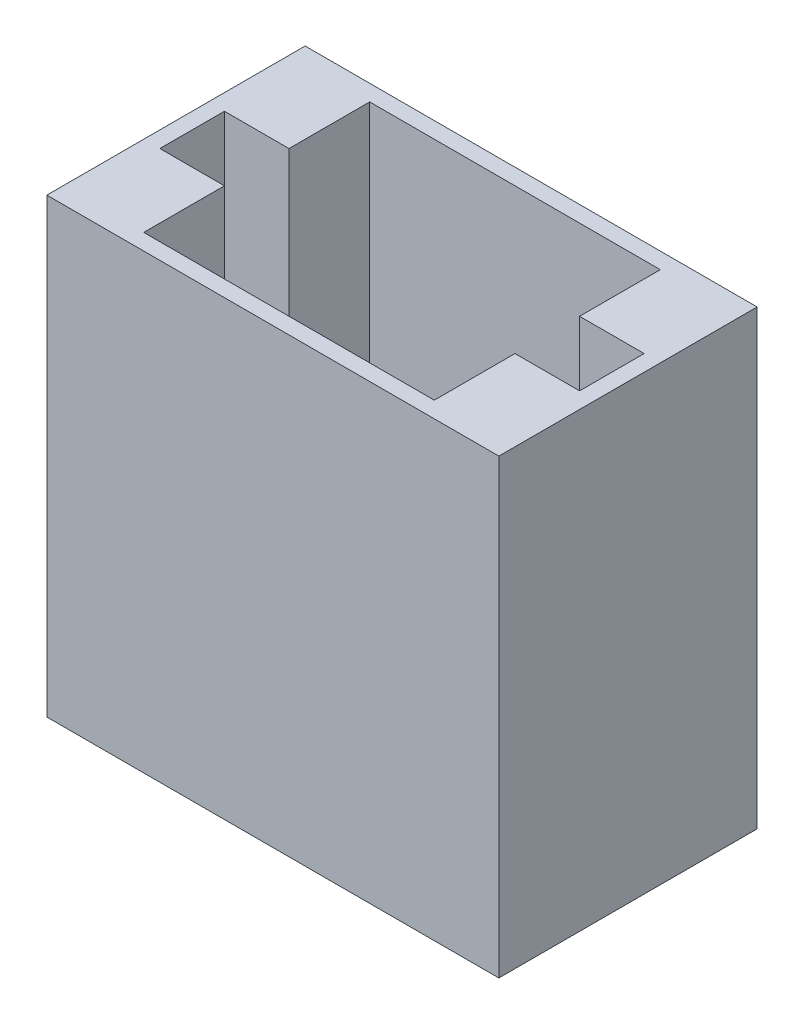
ISO-10303-21;
HEADER;
FILE_DESCRIPTION(('STEP AP214'),'2;1');
FILE_NAME('part.step','',(''),(''),'','','');
FILE_SCHEMA(('AUTOMOTIVE_DESIGN { 1 0 10303 214 1 1 1 1 }'));
ENDSEC;
DATA;
#1=APPLICATION_CONTEXT('core data for automotive mechanical design processes');
#2=APPLICATION_PROTOCOL_DEFINITION('international standard','automotive_design',2000,#1);
#3=PRODUCT_CONTEXT('',#1,'mechanical');
#4=PRODUCT('Part','Part','',(#3));
#5=PRODUCT_RELATED_PRODUCT_CATEGORY('part','',(#4));
#6=PRODUCT_DEFINITION_FORMATION('','',#4);
#7=PRODUCT_DEFINITION_CONTEXT('part definition',#1,'design');
#8=PRODUCT_DEFINITION('design','',#6,#7);
#9=PRODUCT_DEFINITION_SHAPE('','',#8);
#10=(LENGTH_UNIT() NAMED_UNIT(*) SI_UNIT(.MILLI.,.METRE.));
#11=(NAMED_UNIT(*) PLANE_ANGLE_UNIT() SI_UNIT($,.RADIAN.));
#12=(NAMED_UNIT(*) SI_UNIT($,.STERADIAN.) SOLID_ANGLE_UNIT());
#13=UNCERTAINTY_MEASURE_WITH_UNIT(LENGTH_MEASURE(1.E-05),#10,'distance_accuracy_value','');
#14=(GEOMETRIC_REPRESENTATION_CONTEXT(3) GLOBAL_UNCERTAINTY_ASSIGNED_CONTEXT((#13)) GLOBAL_UNIT_ASSIGNED_CONTEXT((#10,
#11,#12)) REPRESENTATION_CONTEXT('',''));
#15=CARTESIAN_POINT('',(0.,0.,0.));
#16=DIRECTION('',(0.,0.,1.));
#17=DIRECTION('',(1.,0.,0.));
#18=AXIS2_PLACEMENT_3D('',#15,#16,#17);
#19=CARTESIAN_POINT('',(32.5,0.,-17.5));
#20=DIRECTION('',(1.,0.,0.));
#21=DIRECTION('',(0.,0.,-1.));
#22=AXIS2_PLACEMENT_3D('',#19,#20,#21);
#23=PLANE('',#22);
#24=DIRECTION('',(0.,0.,-1.));
#25=VECTOR('',#24,1.);
#26=CARTESIAN_POINT('',(32.5,70.,-17.5));
#27=LINE('',#26,#25);
#28=CARTESIAN_POINT('',(32.5,70.,5.));
#29=VERTEX_POINT('',#28);
#30=CARTESIAN_POINT('',(32.5,70.,-5.));
#31=VERTEX_POINT('',#30);
#32=EDGE_CURVE('E182',#29,#31,#27,.T.);
#33=ORIENTED_EDGE('',*,*,#32,.T.);
#34=DIRECTION('',(0.,-1.,0.));
#35=VECTOR('',#34,1.);
#36=CARTESIAN_POINT('',(32.5,0.,-5.));
#37=LINE('',#36,#35);
#38=CARTESIAN_POINT('',(32.5,0.,-5.));
#39=VERTEX_POINT('',#38);
#40=EDGE_CURVE('E439',#31,#39,#37,.T.);
#41=ORIENTED_EDGE('',*,*,#40,.T.);
#42=DIRECTION('',(0.,0.,-1.));
#43=VECTOR('',#42,1.);
#44=CARTESIAN_POINT('',(32.5,0.,-17.5));
#45=LINE('',#44,#43);
#46=CARTESIAN_POINT('',(32.5,0.,5.));
#47=VERTEX_POINT('',#46);
#48=EDGE_CURVE('E171',#47,#39,#45,.T.);
#49=ORIENTED_EDGE('',*,*,#48,.F.);
#50=DIRECTION('',(0.,-1.,0.));
#51=VECTOR('',#50,1.);
#52=CARTESIAN_POINT('',(32.5,0.,5.));
#53=LINE('',#52,#51);
#54=EDGE_CURVE('E446',#29,#47,#53,.T.);
#55=ORIENTED_EDGE('',*,*,#54,.F.);
#56=EDGE_LOOP('',(#33,#41,#49,#55));
#57=FACE_BOUND('',#56,.T.);
#58=ADVANCED_FACE('F35',(#57),#23,.F.);
#59=CARTESIAN_POINT('',(-32.5,0.,-17.5));
#60=DIRECTION('',(-1.,0.,0.));
#61=DIRECTION('',(0.,0.,1.));
#62=AXIS2_PLACEMENT_3D('',#59,#60,#61);
#63=PLANE('',#62);
#64=DIRECTION('',(0.,-1.,0.));
#65=VECTOR('',#64,1.);
#66=CARTESIAN_POINT('',(-32.5,0.,-5.));
#67=LINE('',#66,#65);
#68=CARTESIAN_POINT('',(-32.5,70.,-5.));
#69=VERTEX_POINT('',#68);
#70=CARTESIAN_POINT('',(-32.5,0.,-5.));
#71=VERTEX_POINT('',#70);
#72=EDGE_CURVE('E465',#69,#71,#67,.T.);
#73=ORIENTED_EDGE('',*,*,#72,.F.);
#74=DIRECTION('',(0.,0.,1.));
#75=VECTOR('',#74,1.);
#76=CARTESIAN_POINT('',(-32.5,70.,-17.5));
#77=LINE('',#76,#75);
#78=CARTESIAN_POINT('',(-32.5,70.,5.));
#79=VERTEX_POINT('',#78);
#80=EDGE_CURVE('E188',#69,#79,#77,.T.);
#81=ORIENTED_EDGE('',*,*,#80,.T.);
#82=DIRECTION('',(0.,-1.,0.));
#83=VECTOR('',#82,1.);
#84=CARTESIAN_POINT('',(-32.5,0.,5.));
#85=LINE('',#84,#83);
#86=CARTESIAN_POINT('',(-32.5,0.,5.));
#87=VERTEX_POINT('',#86);
#88=EDGE_CURVE('E480',#79,#87,#85,.T.);
#89=ORIENTED_EDGE('',*,*,#88,.T.);
#90=DIRECTION('',(0.,0.,1.));
#91=VECTOR('',#90,1.);
#92=CARTESIAN_POINT('',(-32.5,0.,-17.5));
#93=LINE('',#92,#91);
#94=EDGE_CURVE('E170',#71,#87,#93,.T.);
#95=ORIENTED_EDGE('',*,*,#94,.F.);
#96=EDGE_LOOP('',(#73,#81,#89,#95));
#97=FACE_BOUND('',#96,.T.);
#98=ADVANCED_FACE('F240',(#97),#63,.F.);
#99=CARTESIAN_POINT('',(35.,70.,20.));
#100=DIRECTION('',(-1.,0.,0.));
#101=DIRECTION('',(0.,0.,1.));
#102=AXIS2_PLACEMENT_3D('',#99,#100,#101);
#103=PLANE('',#102);
#104=DIRECTION('',(0.,0.,-1.));
#105=VECTOR('',#104,1.);
#106=CARTESIAN_POINT('',(35.,0.,20.));
#107=LINE('',#106,#105);
#108=CARTESIAN_POINT('',(35.,0.,20.));
#109=VERTEX_POINT('',#108);
#110=CARTESIAN_POINT('',(35.,0.,-20.));
#111=VERTEX_POINT('',#110);
#112=EDGE_CURVE('E181',#109,#111,#107,.T.);
#113=ORIENTED_EDGE('',*,*,#112,.T.);
#114=DIRECTION('',(0.,-1.,0.));
#115=VECTOR('',#114,1.);
#116=CARTESIAN_POINT('',(35.,70.,-20.));
#117=LINE('',#116,#115);
#118=CARTESIAN_POINT('',(35.,70.,-20.));
#119=VERTEX_POINT('',#118);
#120=EDGE_CURVE('E11',#119,#111,#117,.T.);
#121=ORIENTED_EDGE('',*,*,#120,.F.);
#122=DIRECTION('',(0.,0.,-1.));
#123=VECTOR('',#122,1.);
#124=CARTESIAN_POINT('',(35.,70.,20.));
#125=LINE('',#124,#123);
#126=CARTESIAN_POINT('',(35.,70.,20.));
#127=VERTEX_POINT('',#126);
#128=EDGE_CURVE('E192',#127,#119,#125,.T.);
#129=ORIENTED_EDGE('',*,*,#128,.F.);
#130=DIRECTION('',(0.,-1.,0.));
#131=VECTOR('',#130,1.);
#132=CARTESIAN_POINT('',(35.,70.,20.));
#133=LINE('',#132,#131);
#134=EDGE_CURVE('E202',#127,#109,#133,.T.);
#135=ORIENTED_EDGE('',*,*,#134,.T.);
#136=EDGE_LOOP('',(#113,#121,#129,#135));
#137=FACE_BOUND('',#136,.T.);
#138=ADVANCED_FACE('F37',(#137),#103,.F.);
#139=CARTESIAN_POINT('',(-35.,70.,-20.));
#140=DIRECTION('',(0.,0.,1.));
#141=DIRECTION('',(1.,0.,0.));
#142=AXIS2_PLACEMENT_3D('',#139,#140,#141);
#143=PLANE('',#142);
#144=DIRECTION('',(-1.,0.,0.));
#145=VECTOR('',#144,1.);
#146=CARTESIAN_POINT('',(-35.,0.,-20.));
#147=LINE('',#146,#145);
#148=CARTESIAN_POINT('',(-35.,0.,-20.));
#149=VERTEX_POINT('',#148);
#150=EDGE_CURVE('E205',#111,#149,#147,.T.);
#151=ORIENTED_EDGE('',*,*,#150,.T.);
#152=DIRECTION('',(0.,-1.,0.));
#153=VECTOR('',#152,1.);
#154=CARTESIAN_POINT('',(-35.,70.,-20.));
#155=LINE('',#154,#153);
#156=CARTESIAN_POINT('',(-35.,70.,-20.));
#157=VERTEX_POINT('',#156);
#158=EDGE_CURVE('E43',#157,#149,#155,.T.);
#159=ORIENTED_EDGE('',*,*,#158,.F.);
#160=DIRECTION('',(-1.,0.,0.));
#161=VECTOR('',#160,1.);
#162=CARTESIAN_POINT('',(-35.,70.,-20.));
#163=LINE('',#162,#161);
#164=EDGE_CURVE('E195',#119,#157,#163,.T.);
#165=ORIENTED_EDGE('',*,*,#164,.F.);
#166=ORIENTED_EDGE('',*,*,#120,.T.);
#167=EDGE_LOOP('',(#151,#159,#165,#166));
#168=FACE_BOUND('',#167,.T.);
#169=ADVANCED_FACE('F233',(#168),#143,.F.);
#170=CARTESIAN_POINT('',(-35.,70.,20.));
#171=DIRECTION('',(1.,0.,0.));
#172=DIRECTION('',(0.,0.,-1.));
#173=AXIS2_PLACEMENT_3D('',#170,#171,#172);
#174=PLANE('',#173);
#175=DIRECTION('',(0.,0.,1.));
#176=VECTOR('',#175,1.);
#177=CARTESIAN_POINT('',(-35.,0.,20.));
#178=LINE('',#177,#176);
#179=CARTESIAN_POINT('',(-35.,0.,20.));
#180=VERTEX_POINT('',#179);
#181=EDGE_CURVE('E207',#149,#180,#178,.T.);
#182=ORIENTED_EDGE('',*,*,#181,.T.);
#183=DIRECTION('',(0.,-1.,0.));
#184=VECTOR('',#183,1.);
#185=CARTESIAN_POINT('',(-35.,70.,20.));
#186=LINE('',#185,#184);
#187=CARTESIAN_POINT('',(-35.,70.,20.));
#188=VERTEX_POINT('',#187);
#189=EDGE_CURVE('E212',#188,#180,#186,.T.);
#190=ORIENTED_EDGE('',*,*,#189,.F.);
#191=DIRECTION('',(0.,0.,1.));
#192=VECTOR('',#191,1.);
#193=CARTESIAN_POINT('',(-35.,70.,20.));
#194=LINE('',#193,#192);
#195=EDGE_CURVE('E198',#157,#188,#194,.T.);
#196=ORIENTED_EDGE('',*,*,#195,.F.);
#197=ORIENTED_EDGE('',*,*,#158,.T.);
#198=EDGE_LOOP('',(#182,#190,#196,#197));
#199=FACE_BOUND('',#198,.T.);
#200=ADVANCED_FACE('F219',(#199),#174,.F.);
#201=CARTESIAN_POINT('',(-35.,70.,20.));
#202=DIRECTION('',(0.,0.,-1.));
#203=DIRECTION('',(-1.,0.,0.));
#204=AXIS2_PLACEMENT_3D('',#201,#202,#203);
#205=PLANE('',#204);
#206=DIRECTION('',(1.,0.,0.));
#207=VECTOR('',#206,1.);
#208=CARTESIAN_POINT('',(-35.,0.,20.));
#209=LINE('',#208,#207);
#210=EDGE_CURVE('E196',#180,#109,#209,.T.);
#211=ORIENTED_EDGE('',*,*,#210,.T.);
#212=ORIENTED_EDGE('',*,*,#134,.F.);
#213=DIRECTION('',(1.,0.,0.));
#214=VECTOR('',#213,1.);
#215=CARTESIAN_POINT('',(-35.,70.,20.));
#216=LINE('',#215,#214);
#217=EDGE_CURVE('E200',#188,#127,#216,.T.);
#218=ORIENTED_EDGE('',*,*,#217,.F.);
#219=ORIENTED_EDGE('',*,*,#189,.T.);
#220=EDGE_LOOP('',(#211,#212,#218,#219));
#221=FACE_BOUND('',#220,.T.);
#222=ADVANCED_FACE('F226',(#221),#205,.F.);
#223=CARTESIAN_POINT('',(0.,70.,0.));
#224=DIRECTION('',(0.,-1.,0.));
#225=DIRECTION('',(0.,0.,-1.));
#226=AXIS2_PLACEMENT_3D('',#223,#224,#225);
#227=PLANE('',#226);
#228=DIRECTION('',(1.,0.,0.));
#229=VECTOR('',#228,1.);
#230=CARTESIAN_POINT('',(22.5,70.,-5.));
#231=LINE('',#230,#229);
#232=CARTESIAN_POINT('',(22.5,70.,-5.));
#233=VERTEX_POINT('',#232);
#234=EDGE_CURVE('E440',#233,#31,#231,.T.);
#235=ORIENTED_EDGE('',*,*,#234,.T.);
#236=ORIENTED_EDGE('',*,*,#32,.F.);
#237=DIRECTION('',(1.,0.,0.));
#238=VECTOR('',#237,1.);
#239=CARTESIAN_POINT('',(22.5,70.,5.));
#240=LINE('',#239,#238);
#241=CARTESIAN_POINT('',(22.5,70.,5.));
#242=VERTEX_POINT('',#241);
#243=EDGE_CURVE('E448',#242,#29,#240,.T.);
#244=ORIENTED_EDGE('',*,*,#243,.F.);
#245=DIRECTION('',(0.,0.,1.));
#246=VECTOR('',#245,1.);
#247=CARTESIAN_POINT('',(22.5,70.,0.));
#248=LINE('',#247,#246);
#249=CARTESIAN_POINT('',(22.5,70.,17.5));
#250=VERTEX_POINT('',#249);
#251=EDGE_CURVE('E459',#242,#250,#248,.T.);
#252=ORIENTED_EDGE('',*,*,#251,.T.);
#253=DIRECTION('',(1.,0.,0.));
#254=VECTOR('',#253,1.);
#255=CARTESIAN_POINT('',(-32.5,70.,17.5));
#256=LINE('',#255,#254);
#257=CARTESIAN_POINT('',(-22.5,70.,17.5));
#258=VERTEX_POINT('',#257);
#259=EDGE_CURVE('E175',#258,#250,#256,.T.);
#260=ORIENTED_EDGE('',*,*,#259,.F.);
#261=DIRECTION('',(0.,0.,1.));
#262=VECTOR('',#261,1.);
#263=CARTESIAN_POINT('',(-22.5,70.,0.));
#264=LINE('',#263,#262);
#265=CARTESIAN_POINT('',(-22.5,70.,5.));
#266=VERTEX_POINT('',#265);
#267=EDGE_CURVE('E484',#266,#258,#264,.T.);
#268=ORIENTED_EDGE('',*,*,#267,.F.);
#269=DIRECTION('',(-1.,0.,0.));
#270=VECTOR('',#269,1.);
#271=CARTESIAN_POINT('',(-22.5,70.,5.));
#272=LINE('',#271,#270);
#273=EDGE_CURVE('E186',#266,#79,#272,.T.);
#274=ORIENTED_EDGE('',*,*,#273,.T.);
#275=ORIENTED_EDGE('',*,*,#80,.F.);
#276=DIRECTION('',(-1.,0.,0.));
#277=VECTOR('',#276,1.);
#278=CARTESIAN_POINT('',(-22.5,70.,-5.));
#279=LINE('',#278,#277);
#280=CARTESIAN_POINT('',(-22.5,70.,-5.));
#281=VERTEX_POINT('',#280);
#282=EDGE_CURVE('E478',#281,#69,#279,.T.);
#283=ORIENTED_EDGE('',*,*,#282,.F.);
#284=DIRECTION('',(0.,0.,1.));
#285=VECTOR('',#284,1.);
#286=CARTESIAN_POINT('',(-22.5,70.,0.));
#287=LINE('',#286,#285);
#288=CARTESIAN_POINT('',(-22.5,70.,-17.5));
#289=VERTEX_POINT('',#288);
#290=EDGE_CURVE('E466',#289,#281,#287,.T.);
#291=ORIENTED_EDGE('',*,*,#290,.F.);
#292=DIRECTION('',(-1.,0.,0.));
#293=VECTOR('',#292,1.);
#294=CARTESIAN_POINT('',(-32.5,70.,-17.5));
#295=LINE('',#294,#293);
#296=CARTESIAN_POINT('',(22.5,70.,-17.5));
#297=VERTEX_POINT('',#296);
#298=EDGE_CURVE('E185',#297,#289,#295,.T.);
#299=ORIENTED_EDGE('',*,*,#298,.F.);
#300=DIRECTION('',(0.,0.,1.));
#301=VECTOR('',#300,1.);
#302=CARTESIAN_POINT('',(22.5,70.,0.));
#303=LINE('',#302,#301);
#304=EDGE_CURVE('E50',#297,#233,#303,.T.);
#305=ORIENTED_EDGE('',*,*,#304,.T.);
#306=EDGE_LOOP('',(#235,#236,#244,#252,#260,#268,#274,#275,#283,#291,#299,#305));
#307=FACE_BOUND('',#306,.T.);
#308=ORIENTED_EDGE('',*,*,#128,.T.);
#309=ORIENTED_EDGE('',*,*,#164,.T.);
#310=ORIENTED_EDGE('',*,*,#195,.T.);
#311=ORIENTED_EDGE('',*,*,#217,.T.);
#312=EDGE_LOOP('',(#308,#309,#310,#311));
#313=FACE_BOUND('',#312,.T.);
#314=ADVANCED_FACE('F232',(#307,#313),#227,.F.);
#315=CARTESIAN_POINT('',(0.,0.,0.));
#316=DIRECTION('',(0.,-1.,0.));
#317=DIRECTION('',(0.,0.,-1.));
#318=AXIS2_PLACEMENT_3D('',#315,#316,#317);
#319=PLANE('',#318);
#320=DIRECTION('',(1.,0.,0.));
#321=VECTOR('',#320,1.);
#322=CARTESIAN_POINT('',(22.5,0.,5.));
#323=LINE('',#322,#321);
#324=CARTESIAN_POINT('',(22.5,0.,5.));
#325=VERTEX_POINT('',#324);
#326=EDGE_CURVE('E463',#325,#47,#323,.T.);
#327=ORIENTED_EDGE('',*,*,#326,.T.);
#328=ORIENTED_EDGE('',*,*,#48,.T.);
#329=DIRECTION('',(1.,0.,0.));
#330=VECTOR('',#329,1.);
#331=CARTESIAN_POINT('',(22.5,0.,-5.));
#332=LINE('',#331,#330);
#333=CARTESIAN_POINT('',(22.5,0.,-5.));
#334=VERTEX_POINT('',#333);
#335=EDGE_CURVE('E163',#334,#39,#332,.T.);
#336=ORIENTED_EDGE('',*,*,#335,.F.);
#337=DIRECTION('',(0.,0.,-1.));
#338=VECTOR('',#337,1.);
#339=CARTESIAN_POINT('',(22.5,0.,0.));
#340=LINE('',#339,#338);
#341=CARTESIAN_POINT('',(22.5,0.,-17.5));
#342=VERTEX_POINT('',#341);
#343=EDGE_CURVE('E150',#334,#342,#340,.T.);
#344=ORIENTED_EDGE('',*,*,#343,.T.);
#345=DIRECTION('',(-1.,0.,0.));
#346=VECTOR('',#345,1.);
#347=CARTESIAN_POINT('',(-32.5,0.,-17.5));
#348=LINE('',#347,#346);
#349=CARTESIAN_POINT('',(-22.5,0.,-17.5));
#350=VERTEX_POINT('',#349);
#351=EDGE_CURVE('E160',#342,#350,#348,.T.);
#352=ORIENTED_EDGE('',*,*,#351,.T.);
#353=DIRECTION('',(0.,0.,-1.));
#354=VECTOR('',#353,1.);
#355=CARTESIAN_POINT('',(-22.5,0.,0.));
#356=LINE('',#355,#354);
#357=CARTESIAN_POINT('',(-22.5,0.,-5.));
#358=VERTEX_POINT('',#357);
#359=EDGE_CURVE('E471',#358,#350,#356,.T.);
#360=ORIENTED_EDGE('',*,*,#359,.F.);
#361=DIRECTION('',(-1.,0.,0.));
#362=VECTOR('',#361,1.);
#363=CARTESIAN_POINT('',(-22.5,0.,-5.));
#364=LINE('',#363,#362);
#365=EDGE_CURVE('E474',#358,#71,#364,.T.);
#366=ORIENTED_EDGE('',*,*,#365,.T.);
#367=ORIENTED_EDGE('',*,*,#94,.T.);
#368=DIRECTION('',(-1.,0.,0.));
#369=VECTOR('',#368,1.);
#370=CARTESIAN_POINT('',(-22.5,0.,5.));
#371=LINE('',#370,#369);
#372=CARTESIAN_POINT('',(-22.5,0.,5.));
#373=VERTEX_POINT('',#372);
#374=EDGE_CURVE('E490',#373,#87,#371,.T.);
#375=ORIENTED_EDGE('',*,*,#374,.F.);
#376=DIRECTION('',(0.,0.,-1.));
#377=VECTOR('',#376,1.);
#378=CARTESIAN_POINT('',(-22.5,0.,0.));
#379=LINE('',#378,#377);
#380=CARTESIAN_POINT('',(-22.5,0.,17.5));
#381=VERTEX_POINT('',#380);
#382=EDGE_CURVE('E488',#381,#373,#379,.T.);
#383=ORIENTED_EDGE('',*,*,#382,.F.);
#384=DIRECTION('',(1.,0.,0.));
#385=VECTOR('',#384,1.);
#386=CARTESIAN_POINT('',(-32.5,0.,17.5));
#387=LINE('',#386,#385);
#388=CARTESIAN_POINT('',(22.5,0.,17.5));
#389=VERTEX_POINT('',#388);
#390=EDGE_CURVE('E173',#381,#389,#387,.T.);
#391=ORIENTED_EDGE('',*,*,#390,.T.);
#392=DIRECTION('',(0.,0.,-1.));
#393=VECTOR('',#392,1.);
#394=CARTESIAN_POINT('',(22.5,0.,0.));
#395=LINE('',#394,#393);
#396=EDGE_CURVE('E58',#389,#325,#395,.T.);
#397=ORIENTED_EDGE('',*,*,#396,.T.);
#398=EDGE_LOOP('',(#327,#328,#336,#344,#352,#360,#366,#367,#375,#383,#391,#397));
#399=FACE_BOUND('',#398,.T.);
#400=ORIENTED_EDGE('',*,*,#112,.F.);
#401=ORIENTED_EDGE('',*,*,#210,.F.);
#402=ORIENTED_EDGE('',*,*,#181,.F.);
#403=ORIENTED_EDGE('',*,*,#150,.F.);
#404=EDGE_LOOP('',(#400,#401,#402,#403));
#405=FACE_BOUND('',#404,.T.);
#406=ADVANCED_FACE('F157',(#399,#405),#319,.T.);
#407=CARTESIAN_POINT('',(-32.5,0.,17.5));
#408=DIRECTION('',(0.,0.,1.));
#409=DIRECTION('',(1.,0.,0.));
#410=AXIS2_PLACEMENT_3D('',#407,#408,#409);
#411=PLANE('',#410);
#412=ORIENTED_EDGE('',*,*,#259,.T.);
#413=DIRECTION('',(0.,-1.,0.));
#414=VECTOR('',#413,1.);
#415=CARTESIAN_POINT('',(22.5,0.,17.5));
#416=LINE('',#415,#414);
#417=EDGE_CURVE('E457',#250,#389,#416,.T.);
#418=ORIENTED_EDGE('',*,*,#417,.T.);
#419=ORIENTED_EDGE('',*,*,#390,.F.);
#420=DIRECTION('',(0.,-1.,0.));
#421=VECTOR('',#420,1.);
#422=CARTESIAN_POINT('',(-22.5,0.,17.5));
#423=LINE('',#422,#421);
#424=EDGE_CURVE('E486',#258,#381,#423,.T.);
#425=ORIENTED_EDGE('',*,*,#424,.F.);
#426=EDGE_LOOP('',(#412,#418,#419,#425));
#427=FACE_BOUND('',#426,.T.);
#428=ADVANCED_FACE('F256',(#427),#411,.F.);
#429=CARTESIAN_POINT('',(-32.5,0.,-17.5));
#430=DIRECTION('',(0.,0.,-1.));
#431=DIRECTION('',(-1.,0.,0.));
#432=AXIS2_PLACEMENT_3D('',#429,#430,#431);
#433=PLANE('',#432);
#434=ORIENTED_EDGE('',*,*,#351,.F.);
#435=DIRECTION('',(0.,1.,0.));
#436=VECTOR('',#435,1.);
#437=CARTESIAN_POINT('',(22.5,0.,-17.5));
#438=LINE('',#437,#436);
#439=EDGE_CURVE('E147',#342,#297,#438,.T.);
#440=ORIENTED_EDGE('',*,*,#439,.T.);
#441=ORIENTED_EDGE('',*,*,#298,.T.);
#442=DIRECTION('',(0.,1.,0.));
#443=VECTOR('',#442,1.);
#444=CARTESIAN_POINT('',(-22.5,0.,-17.5));
#445=LINE('',#444,#443);
#446=EDGE_CURVE('E169',#350,#289,#445,.T.);
#447=ORIENTED_EDGE('',*,*,#446,.F.);
#448=EDGE_LOOP('',(#434,#440,#441,#447));
#449=FACE_BOUND('',#448,.T.);
#450=ADVANCED_FACE('F167',(#449),#433,.F.);
#451=CARTESIAN_POINT('',(-22.5,0.,4.99999999999999));
#452=DIRECTION('',(0.,0.,-1.));
#453=DIRECTION('',(-1.,0.,0.));
#454=AXIS2_PLACEMENT_3D('',#451,#452,#453);
#455=PLANE('',#454);
#456=ORIENTED_EDGE('',*,*,#88,.F.);
#457=ORIENTED_EDGE('',*,*,#273,.F.);
#458=DIRECTION('',(0.,-1.,0.));
#459=VECTOR('',#458,1.);
#460=CARTESIAN_POINT('',(-22.5,0.,4.99999999999999));
#461=LINE('',#460,#459);
#462=EDGE_CURVE('E481',#266,#373,#461,.T.);
#463=ORIENTED_EDGE('',*,*,#462,.T.);
#464=ORIENTED_EDGE('',*,*,#374,.T.);
#465=EDGE_LOOP('',(#456,#457,#463,#464));
#466=FACE_BOUND('',#465,.T.);
#467=ADVANCED_FACE('F284',(#466),#455,.T.);
#468=CARTESIAN_POINT('',(-22.5,0.,0.));
#469=DIRECTION('',(1.,0.,0.));
#470=DIRECTION('',(0.,0.,-1.));
#471=AXIS2_PLACEMENT_3D('',#468,#469,#470);
#472=PLANE('',#471);
#473=ORIENTED_EDGE('',*,*,#462,.F.);
#474=ORIENTED_EDGE('',*,*,#267,.T.);
#475=ORIENTED_EDGE('',*,*,#424,.T.);
#476=ORIENTED_EDGE('',*,*,#382,.T.);
#477=EDGE_LOOP('',(#473,#474,#475,#476));
#478=FACE_BOUND('',#477,.T.);
#479=ADVANCED_FACE('F291',(#478),#472,.T.);
#480=CARTESIAN_POINT('',(-22.5,0.,-5.00000000000001));
#481=DIRECTION('',(0.,0.,-1.));
#482=DIRECTION('',(-1.,0.,0.));
#483=AXIS2_PLACEMENT_3D('',#480,#481,#482);
#484=PLANE('',#483);
#485=ORIENTED_EDGE('',*,*,#72,.T.);
#486=ORIENTED_EDGE('',*,*,#365,.F.);
#487=DIRECTION('',(0.,-1.,0.));
#488=VECTOR('',#487,1.);
#489=CARTESIAN_POINT('',(-22.5,0.,-5.00000000000001));
#490=LINE('',#489,#488);
#491=EDGE_CURVE('E469',#281,#358,#490,.T.);
#492=ORIENTED_EDGE('',*,*,#491,.F.);
#493=ORIENTED_EDGE('',*,*,#282,.T.);
#494=EDGE_LOOP('',(#485,#486,#492,#493));
#495=FACE_BOUND('',#494,.T.);
#496=ADVANCED_FACE('F299',(#495),#484,.F.);
#497=CARTESIAN_POINT('',(-22.5,0.,0.));
#498=DIRECTION('',(1.,0.,0.));
#499=DIRECTION('',(0.,0.,-1.));
#500=AXIS2_PLACEMENT_3D('',#497,#498,#499);
#501=PLANE('',#500);
#502=ORIENTED_EDGE('',*,*,#290,.T.);
#503=ORIENTED_EDGE('',*,*,#491,.T.);
#504=ORIENTED_EDGE('',*,*,#359,.T.);
#505=ORIENTED_EDGE('',*,*,#446,.T.);
#506=EDGE_LOOP('',(#502,#503,#504,#505));
#507=FACE_BOUND('',#506,.T.);
#508=ADVANCED_FACE('F307',(#507),#501,.T.);
#509=CARTESIAN_POINT('',(22.5,0.,4.99999999999999));
#510=DIRECTION('',(0.,0.,1.));
#511=DIRECTION('',(1.,0.,0.));
#512=AXIS2_PLACEMENT_3D('',#509,#510,#511);
#513=PLANE('',#512);
#514=ORIENTED_EDGE('',*,*,#54,.T.);
#515=ORIENTED_EDGE('',*,*,#326,.F.);
#516=DIRECTION('',(0.,-1.,0.));
#517=VECTOR('',#516,1.);
#518=CARTESIAN_POINT('',(22.5,0.,4.99999999999999));
#519=LINE('',#518,#517);
#520=EDGE_CURVE('E454',#242,#325,#519,.T.);
#521=ORIENTED_EDGE('',*,*,#520,.F.);
#522=ORIENTED_EDGE('',*,*,#243,.T.);
#523=EDGE_LOOP('',(#514,#515,#521,#522));
#524=FACE_BOUND('',#523,.T.);
#525=ADVANCED_FACE('F315',(#524),#513,.F.);
#526=CARTESIAN_POINT('',(22.5,0.,0.));
#527=DIRECTION('',(-1.,0.,0.));
#528=DIRECTION('',(0.,0.,-1.));
#529=AXIS2_PLACEMENT_3D('',#526,#527,#528);
#530=PLANE('',#529);
#531=ORIENTED_EDGE('',*,*,#520,.T.);
#532=ORIENTED_EDGE('',*,*,#396,.F.);
#533=ORIENTED_EDGE('',*,*,#417,.F.);
#534=ORIENTED_EDGE('',*,*,#251,.F.);
#535=EDGE_LOOP('',(#531,#532,#533,#534));
#536=FACE_BOUND('',#535,.T.);
#537=ADVANCED_FACE('F322',(#536),#530,.T.);
#538=CARTESIAN_POINT('',(22.5,0.,-5.00000000000001));
#539=DIRECTION('',(0.,0.,1.));
#540=DIRECTION('',(1.,0.,0.));
#541=AXIS2_PLACEMENT_3D('',#538,#539,#540);
#542=PLANE('',#541);
#543=ORIENTED_EDGE('',*,*,#40,.F.);
#544=ORIENTED_EDGE('',*,*,#234,.F.);
#545=DIRECTION('',(0.,-1.,0.));
#546=VECTOR('',#545,1.);
#547=CARTESIAN_POINT('',(22.5,0.,-5.00000000000001));
#548=LINE('',#547,#546);
#549=EDGE_CURVE('E164',#233,#334,#548,.T.);
#550=ORIENTED_EDGE('',*,*,#549,.T.);
#551=ORIENTED_EDGE('',*,*,#335,.T.);
#552=EDGE_LOOP('',(#543,#544,#550,#551));
#553=FACE_BOUND('',#552,.T.);
#554=ADVANCED_FACE('F330',(#553),#542,.T.);
#555=CARTESIAN_POINT('',(22.5,0.,0.));
#556=DIRECTION('',(-1.,0.,0.));
#557=DIRECTION('',(0.,0.,-1.));
#558=AXIS2_PLACEMENT_3D('',#555,#556,#557);
#559=PLANE('',#558);
#560=ORIENTED_EDGE('',*,*,#304,.F.);
#561=ORIENTED_EDGE('',*,*,#439,.F.);
#562=ORIENTED_EDGE('',*,*,#343,.F.);
#563=ORIENTED_EDGE('',*,*,#549,.F.);
#564=EDGE_LOOP('',(#560,#561,#562,#563));
#565=FACE_BOUND('',#564,.T.);
#566=ADVANCED_FACE('F149',(#565),#559,.T.);
#567=CLOSED_SHELL('',(#58,#98,#138,#169,#200,#222,#314,#406,#428,#450,#467,#479,#496,#508,#525,
#537,#554,#566));
#568=MANIFOLD_SOLID_BREP('B2',#567);
#569=ADVANCED_BREP_SHAPE_REPRESENTATION('',(#18,#568),#14);
#570=SHAPE_DEFINITION_REPRESENTATION(#9,#569);
ENDSEC;
END-ISO-10303-21;
